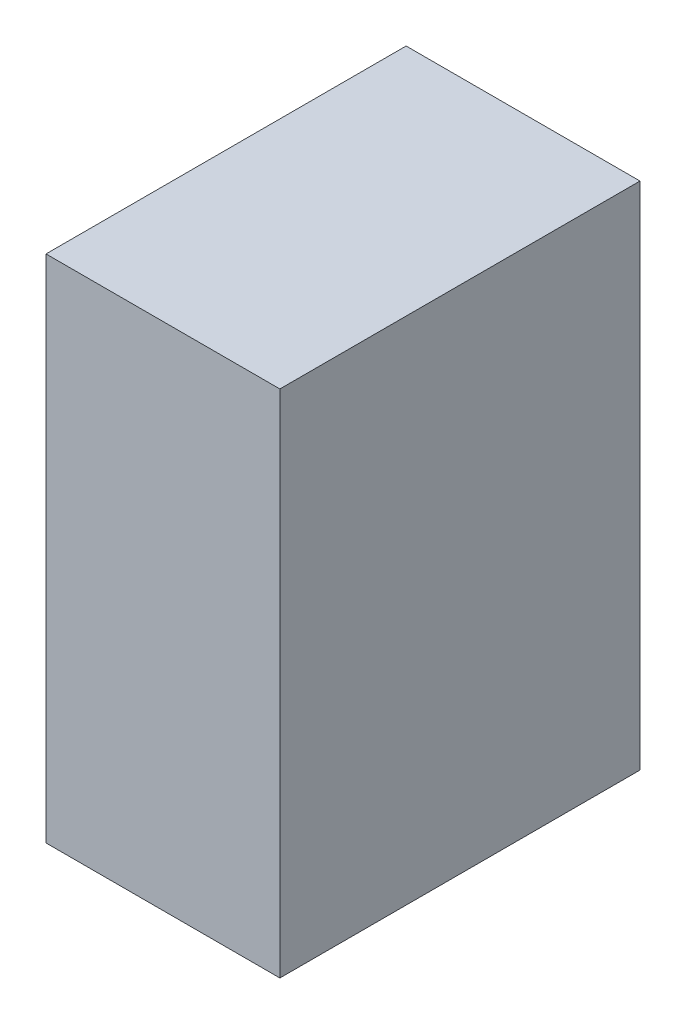
ISO-10303-21;
HEADER;
FILE_DESCRIPTION(('STEP AP214'),'2;1');
FILE_NAME('part.step','',(''),(''),'','','');
FILE_SCHEMA(('AUTOMOTIVE_DESIGN { 1 0 10303 214 1 1 1 1 }'));
ENDSEC;
DATA;
#1=APPLICATION_CONTEXT('core data for automotive mechanical design processes');
#2=APPLICATION_PROTOCOL_DEFINITION('international standard','automotive_design',2000,#1);
#3=PRODUCT_CONTEXT('',#1,'mechanical');
#4=PRODUCT('Part','Part','',(#3));
#5=PRODUCT_RELATED_PRODUCT_CATEGORY('part','',(#4));
#6=PRODUCT_DEFINITION_FORMATION('','',#4);
#7=PRODUCT_DEFINITION_CONTEXT('part definition',#1,'design');
#8=PRODUCT_DEFINITION('design','',#6,#7);
#9=PRODUCT_DEFINITION_SHAPE('','',#8);
#10=(LENGTH_UNIT() NAMED_UNIT(*) SI_UNIT(.MILLI.,.METRE.));
#11=(NAMED_UNIT(*) PLANE_ANGLE_UNIT() SI_UNIT($,.RADIAN.));
#12=(NAMED_UNIT(*) SI_UNIT($,.STERADIAN.) SOLID_ANGLE_UNIT());
#13=UNCERTAINTY_MEASURE_WITH_UNIT(LENGTH_MEASURE(1.E-05),#10,'distance_accuracy_value','');
#14=(GEOMETRIC_REPRESENTATION_CONTEXT(3) GLOBAL_UNCERTAINTY_ASSIGNED_CONTEXT((#13)) GLOBAL_UNIT_ASSIGNED_CONTEXT((#10,
#11,#12)) REPRESENTATION_CONTEXT('',''));
#15=CARTESIAN_POINT('',(0.,0.,0.));
#16=DIRECTION('',(0.,0.,1.));
#17=DIRECTION('',(1.,0.,0.));
#18=AXIS2_PLACEMENT_3D('',#15,#16,#17);
#19=CARTESIAN_POINT('',(34.095,148.74,52.5));
#20=DIRECTION('',(-1.,0.,0.));
#21=DIRECTION('',(0.,0.,1.));
#22=AXIS2_PLACEMENT_3D('',#19,#20,#21);
#23=PLANE('',#22);
#24=DIRECTION('',(0.,0.,-1.));
#25=VECTOR('',#24,1.);
#26=CARTESIAN_POINT('',(34.095,0.,52.5));
#27=LINE('',#26,#25);
#28=CARTESIAN_POINT('',(34.095,0.,52.5));
#29=VERTEX_POINT('',#28);
#30=CARTESIAN_POINT('',(34.095,0.,-52.5));
#31=VERTEX_POINT('',#30);
#32=EDGE_CURVE('E111',#29,#31,#27,.T.);
#33=ORIENTED_EDGE('',*,*,#32,.T.);
#34=DIRECTION('',(0.,-1.,0.));
#35=VECTOR('',#34,1.);
#36=CARTESIAN_POINT('',(34.095,148.74,-52.5));
#37=LINE('',#36,#35);
#38=CARTESIAN_POINT('',(34.095,148.74,-52.5));
#39=VERTEX_POINT('',#38);
#40=EDGE_CURVE('E11',#39,#31,#37,.T.);
#41=ORIENTED_EDGE('',*,*,#40,.F.);
#42=DIRECTION('',(0.,0.,-1.));
#43=VECTOR('',#42,1.);
#44=CARTESIAN_POINT('',(34.095,148.74,52.5));
#45=LINE('',#44,#43);
#46=CARTESIAN_POINT('',(34.095,148.74,52.5));
#47=VERTEX_POINT('',#46);
#48=EDGE_CURVE('E95',#47,#39,#45,.T.);
#49=ORIENTED_EDGE('',*,*,#48,.F.);
#50=DIRECTION('',(0.,-1.,0.));
#51=VECTOR('',#50,1.);
#52=CARTESIAN_POINT('',(34.095,148.74,52.5));
#53=LINE('',#52,#51);
#54=EDGE_CURVE('E107',#47,#29,#53,.T.);
#55=ORIENTED_EDGE('',*,*,#54,.T.);
#56=EDGE_LOOP('',(#33,#41,#49,#55));
#57=FACE_BOUND('',#56,.T.);
#58=ADVANCED_FACE('F43',(#57),#23,.F.);
#59=CARTESIAN_POINT('',(-34.095,148.74,-52.5));
#60=DIRECTION('',(0.,0.,1.));
#61=DIRECTION('',(1.,0.,0.));
#62=AXIS2_PLACEMENT_3D('',#59,#60,#61);
#63=PLANE('',#62);
#64=DIRECTION('',(-1.,0.,0.));
#65=VECTOR('',#64,1.);
#66=CARTESIAN_POINT('',(-34.095,0.,-52.5));
#67=LINE('',#66,#65);
#68=CARTESIAN_POINT('',(-34.095,0.,-52.5));
#69=VERTEX_POINT('',#68);
#70=EDGE_CURVE('E100',#31,#69,#67,.T.);
#71=ORIENTED_EDGE('',*,*,#70,.T.);
#72=DIRECTION('',(0.,-1.,0.));
#73=VECTOR('',#72,1.);
#74=CARTESIAN_POINT('',(-34.095,148.74,-52.5));
#75=LINE('',#74,#73);
#76=CARTESIAN_POINT('',(-34.095,148.74,-52.5));
#77=VERTEX_POINT('',#76);
#78=EDGE_CURVE('E52',#77,#69,#75,.T.);
#79=ORIENTED_EDGE('',*,*,#78,.F.);
#80=DIRECTION('',(-1.,0.,0.));
#81=VECTOR('',#80,1.);
#82=CARTESIAN_POINT('',(-34.095,148.74,-52.5));
#83=LINE('',#82,#81);
#84=EDGE_CURVE('E90',#39,#77,#83,.T.);
#85=ORIENTED_EDGE('',*,*,#84,.F.);
#86=ORIENTED_EDGE('',*,*,#40,.T.);
#87=EDGE_LOOP('',(#71,#79,#85,#86));
#88=FACE_BOUND('',#87,.T.);
#89=ADVANCED_FACE('F99',(#88),#63,.F.);
#90=CARTESIAN_POINT('',(-34.095,148.74,52.5));
#91=DIRECTION('',(1.,0.,0.));
#92=DIRECTION('',(0.,0.,-1.));
#93=AXIS2_PLACEMENT_3D('',#90,#91,#92);
#94=PLANE('',#93);
#95=DIRECTION('',(0.,0.,1.));
#96=VECTOR('',#95,1.);
#97=CARTESIAN_POINT('',(-34.095,0.,52.5));
#98=LINE('',#97,#96);
#99=CARTESIAN_POINT('',(-34.095,0.,52.5));
#100=VERTEX_POINT('',#99);
#101=EDGE_CURVE('E77',#69,#100,#98,.T.);
#102=ORIENTED_EDGE('',*,*,#101,.T.);
#103=DIRECTION('',(0.,-1.,0.));
#104=VECTOR('',#103,1.);
#105=CARTESIAN_POINT('',(-34.095,148.74,52.5));
#106=LINE('',#105,#104);
#107=CARTESIAN_POINT('',(-34.095,148.74,52.5));
#108=VERTEX_POINT('',#107);
#109=EDGE_CURVE('E102',#108,#100,#106,.T.);
#110=ORIENTED_EDGE('',*,*,#109,.F.);
#111=DIRECTION('',(0.,0.,1.));
#112=VECTOR('',#111,1.);
#113=CARTESIAN_POINT('',(-34.095,148.74,52.5));
#114=LINE('',#113,#112);
#115=EDGE_CURVE('E93',#77,#108,#114,.T.);
#116=ORIENTED_EDGE('',*,*,#115,.F.);
#117=ORIENTED_EDGE('',*,*,#78,.T.);
#118=EDGE_LOOP('',(#102,#110,#116,#117));
#119=FACE_BOUND('',#118,.T.);
#120=ADVANCED_FACE('F103',(#119),#94,.F.);
#121=CARTESIAN_POINT('',(-34.095,148.74,52.5));
#122=DIRECTION('',(0.,0.,-1.));
#123=DIRECTION('',(-1.,0.,0.));
#124=AXIS2_PLACEMENT_3D('',#121,#122,#123);
#125=PLANE('',#124);
#126=DIRECTION('',(1.,0.,0.));
#127=VECTOR('',#126,1.);
#128=CARTESIAN_POINT('',(-34.095,0.,52.5));
#129=LINE('',#128,#127);
#130=EDGE_CURVE('E83',#100,#29,#129,.T.);
#131=ORIENTED_EDGE('',*,*,#130,.T.);
#132=ORIENTED_EDGE('',*,*,#54,.F.);
#133=DIRECTION('',(1.,0.,0.));
#134=VECTOR('',#133,1.);
#135=CARTESIAN_POINT('',(-34.095,148.74,52.5));
#136=LINE('',#135,#134);
#137=EDGE_CURVE('E60',#108,#47,#136,.T.);
#138=ORIENTED_EDGE('',*,*,#137,.F.);
#139=ORIENTED_EDGE('',*,*,#109,.T.);
#140=EDGE_LOOP('',(#131,#132,#138,#139));
#141=FACE_BOUND('',#140,.T.);
#142=ADVANCED_FACE('F124',(#141),#125,.F.);
#143=CARTESIAN_POINT('',(0.,148.74,0.));
#144=DIRECTION('',(0.,-1.,0.));
#145=DIRECTION('',(0.,0.,-1.));
#146=AXIS2_PLACEMENT_3D('',#143,#144,#145);
#147=PLANE('',#146);
#148=ORIENTED_EDGE('',*,*,#48,.T.);
#149=ORIENTED_EDGE('',*,*,#84,.T.);
#150=ORIENTED_EDGE('',*,*,#115,.T.);
#151=ORIENTED_EDGE('',*,*,#137,.T.);
#152=EDGE_LOOP('',(#148,#149,#150,#151));
#153=FACE_BOUND('',#152,.T.);
#154=ADVANCED_FACE('F91',(#153),#147,.F.);
#155=CARTESIAN_POINT('',(0.,0.,0.));
#156=DIRECTION('',(0.,-1.,0.));
#157=DIRECTION('',(0.,0.,-1.));
#158=AXIS2_PLACEMENT_3D('',#155,#156,#157);
#159=PLANE('',#158);
#160=ORIENTED_EDGE('',*,*,#32,.F.);
#161=ORIENTED_EDGE('',*,*,#130,.F.);
#162=ORIENTED_EDGE('',*,*,#101,.F.);
#163=ORIENTED_EDGE('',*,*,#70,.F.);
#164=EDGE_LOOP('',(#160,#161,#162,#163));
#165=FACE_BOUND('',#164,.T.);
#166=ADVANCED_FACE('F127',(#165),#159,.T.);
#167=CLOSED_SHELL('',(#58,#89,#120,#142,#154,#166));
#168=MANIFOLD_SOLID_BREP('B2',#167);
#169=ADVANCED_BREP_SHAPE_REPRESENTATION('',(#18,#168),#14);
#170=SHAPE_DEFINITION_REPRESENTATION(#9,#169);
ENDSEC;
END-ISO-10303-21;
